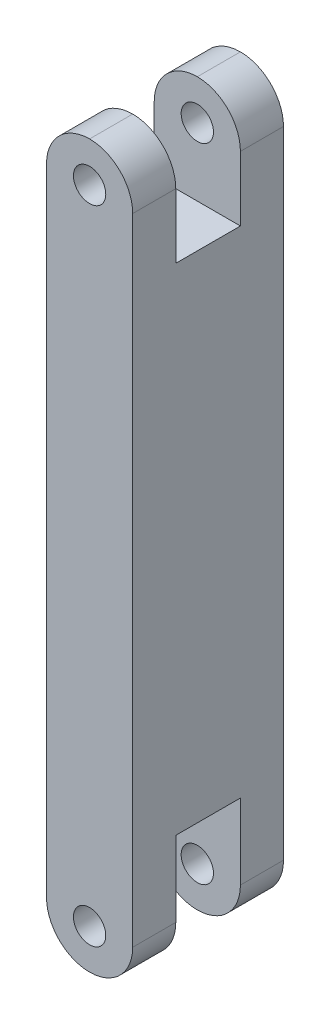
ISO-10303-21;
HEADER;
FILE_DESCRIPTION(('STEP AP214'),'2;1');
FILE_NAME('part.step','',(''),(''),'','','');
FILE_SCHEMA(('AUTOMOTIVE_DESIGN { 1 0 10303 214 1 1 1 1 }'));
ENDSEC;
DATA;
#1=APPLICATION_CONTEXT('core data for automotive mechanical design processes');
#2=APPLICATION_PROTOCOL_DEFINITION('international standard','automotive_design',2000,#1);
#3=PRODUCT_CONTEXT('',#1,'mechanical');
#4=PRODUCT('Part','Part','',(#3));
#5=PRODUCT_RELATED_PRODUCT_CATEGORY('part','',(#4));
#6=PRODUCT_DEFINITION_FORMATION('','',#4);
#7=PRODUCT_DEFINITION_CONTEXT('part definition',#1,'design');
#8=PRODUCT_DEFINITION('design','',#6,#7);
#9=PRODUCT_DEFINITION_SHAPE('','',#8);
#10=(LENGTH_UNIT() NAMED_UNIT(*) SI_UNIT(.MILLI.,.METRE.));
#11=(NAMED_UNIT(*) PLANE_ANGLE_UNIT() SI_UNIT($,.RADIAN.));
#12=(NAMED_UNIT(*) SI_UNIT($,.STERADIAN.) SOLID_ANGLE_UNIT());
#13=UNCERTAINTY_MEASURE_WITH_UNIT(LENGTH_MEASURE(1.E-05),#10,'distance_accuracy_value','');
#14=(GEOMETRIC_REPRESENTATION_CONTEXT(3) GLOBAL_UNCERTAINTY_ASSIGNED_CONTEXT((#13)) GLOBAL_UNIT_ASSIGNED_CONTEXT((#10,
#11,#12)) REPRESENTATION_CONTEXT('',''));
#15=CARTESIAN_POINT('',(0.,0.,0.));
#16=DIRECTION('',(0.,0.,1.));
#17=DIRECTION('',(1.,0.,0.));
#18=AXIS2_PLACEMENT_3D('',#15,#16,#17);
#19=CARTESIAN_POINT('',(0.,29.795,14.));
#20=DIRECTION('',(0.,0.,-1.));
#21=DIRECTION('',(-1.,0.,0.));
#22=AXIS2_PLACEMENT_3D('',#19,#20,#21);
#23=CYLINDRICAL_SURFACE('',#22,1.5);
#24=CARTESIAN_POINT('',(0.,29.795,4.));
#25=DIRECTION('',(0.,0.,-1.));
#26=DIRECTION('',(-1.,0.,0.));
#27=AXIS2_PLACEMENT_3D('',#24,#25,#26);
#28=CIRCLE('',#27,1.5);
#29=CARTESIAN_POINT('',(-1.5,29.795,4.));
#30=VERTEX_POINT('',#29);
#31=EDGE_CURVE('E205',#30,#30,#28,.T.);
#32=ORIENTED_EDGE('',*,*,#31,.F.);
#33=EDGE_LOOP('',(#32));
#34=FACE_BOUND('',#33,.T.);
#35=CARTESIAN_POINT('',(0.,29.795,0.));
#36=DIRECTION('',(0.,0.,1.));
#37=DIRECTION('',(1.,0.,0.));
#38=AXIS2_PLACEMENT_3D('',#35,#36,#37);
#39=CIRCLE('',#38,1.5);
#40=CARTESIAN_POINT('',(1.5,29.795,0.));
#41=VERTEX_POINT('',#40);
#42=EDGE_CURVE('E221',#41,#41,#39,.T.);
#43=ORIENTED_EDGE('',*,*,#42,.F.);
#44=EDGE_LOOP('',(#43));
#45=FACE_BOUND('',#44,.T.);
#46=ADVANCED_FACE('F32',(#34,#45),#23,.F.);
#47=CARTESIAN_POINT('',(0.,-29.795,14.));
#48=DIRECTION('',(0.,0.,-1.));
#49=DIRECTION('',(-1.,0.,0.));
#50=AXIS2_PLACEMENT_3D('',#47,#48,#49);
#51=CYLINDRICAL_SURFACE('',#50,1.5);
#52=CARTESIAN_POINT('',(0.,-29.795,4.));
#53=DIRECTION('',(0.,0.,-1.));
#54=DIRECTION('',(-1.,0.,0.));
#55=AXIS2_PLACEMENT_3D('',#52,#53,#54);
#56=CIRCLE('',#55,1.5);
#57=CARTESIAN_POINT('',(-1.5,-29.795,4.));
#58=VERTEX_POINT('',#57);
#59=EDGE_CURVE('E214',#58,#58,#56,.T.);
#60=ORIENTED_EDGE('',*,*,#59,.F.);
#61=EDGE_LOOP('',(#60));
#62=FACE_BOUND('',#61,.T.);
#63=CARTESIAN_POINT('',(0.,-29.795,0.));
#64=DIRECTION('',(0.,0.,1.));
#65=DIRECTION('',(1.,0.,0.));
#66=AXIS2_PLACEMENT_3D('',#63,#64,#65);
#67=CIRCLE('',#66,1.5);
#68=CARTESIAN_POINT('',(1.5,-29.795,0.));
#69=VERTEX_POINT('',#68);
#70=EDGE_CURVE('E222',#69,#69,#67,.T.);
#71=ORIENTED_EDGE('',*,*,#70,.F.);
#72=EDGE_LOOP('',(#71));
#73=FACE_BOUND('',#72,.T.);
#74=ADVANCED_FACE('F350',(#62,#73),#51,.F.);
#75=CARTESIAN_POINT('',(0.,-29.495,14.));
#76=DIRECTION('',(0.,0.,-1.));
#77=DIRECTION('',(-1.,0.,0.));
#78=AXIS2_PLACEMENT_3D('',#75,#76,#77);
#79=CYLINDRICAL_SURFACE('',#78,4.);
#80=CARTESIAN_POINT('',(0.,-29.495,4.));
#81=DIRECTION('',(0.,0.,-1.));
#82=DIRECTION('',(-1.,0.,0.));
#83=AXIS2_PLACEMENT_3D('',#80,#81,#82);
#84=CIRCLE('',#83,4.);
#85=CARTESIAN_POINT('',(0.,-33.495,4.));
#86=VERTEX_POINT('',#85);
#87=CARTESIAN_POINT('',(4.,-29.495,4.));
#88=VERTEX_POINT('',#87);
#89=EDGE_CURVE('E212',#86,#88,#84,.F.);
#90=ORIENTED_EDGE('',*,*,#89,.F.);
#91=DIRECTION('',(0.,0.,-1.));
#92=VECTOR('',#91,1.);
#93=CARTESIAN_POINT('',(0.,-33.495,14.));
#94=LINE('',#93,#92);
#95=CARTESIAN_POINT('',(0.,-33.495,0.));
#96=VERTEX_POINT('',#95);
#97=EDGE_CURVE('E225',#96,#86,#94,.F.);
#98=ORIENTED_EDGE('',*,*,#97,.F.);
#99=CARTESIAN_POINT('',(0.,-29.495,0.));
#100=DIRECTION('',(0.,0.,-1.));
#101=DIRECTION('',(-1.,0.,0.));
#102=AXIS2_PLACEMENT_3D('',#99,#100,#101);
#103=CIRCLE('',#102,4.);
#104=CARTESIAN_POINT('',(4.,-29.495,0.));
#105=VERTEX_POINT('',#104);
#106=EDGE_CURVE('E247',#105,#96,#103,.T.);
#107=ORIENTED_EDGE('',*,*,#106,.F.);
#108=DIRECTION('',(0.,0.,-1.));
#109=VECTOR('',#108,1.);
#110=CARTESIAN_POINT('',(4.,-29.495,14.));
#111=LINE('',#110,#109);
#112=EDGE_CURVE('E270',#88,#105,#111,.T.);
#113=ORIENTED_EDGE('',*,*,#112,.F.);
#114=EDGE_LOOP('',(#90,#98,#107,#113));
#115=FACE_BOUND('',#114,.T.);
#116=ADVANCED_FACE('F324',(#115),#79,.T.);
#117=CARTESIAN_POINT('',(0.,-29.495,14.));
#118=DIRECTION('',(0.,0.,-1.));
#119=DIRECTION('',(-1.,0.,0.));
#120=AXIS2_PLACEMENT_3D('',#117,#118,#119);
#121=CYLINDRICAL_SURFACE('',#120,4.);
#122=CARTESIAN_POINT('',(0.,-29.495,4.));
#123=DIRECTION('',(0.,0.,-1.));
#124=DIRECTION('',(-1.,0.,0.));
#125=AXIS2_PLACEMENT_3D('',#122,#123,#124);
#126=CIRCLE('',#125,4.);
#127=CARTESIAN_POINT('',(-4.,-29.495,4.));
#128=VERTEX_POINT('',#127);
#129=EDGE_CURVE('E11',#128,#86,#126,.F.);
#130=ORIENTED_EDGE('',*,*,#129,.F.);
#131=DIRECTION('',(0.,0.,-1.));
#132=VECTOR('',#131,1.);
#133=CARTESIAN_POINT('',(-4.,-29.495,14.));
#134=LINE('',#133,#132);
#135=CARTESIAN_POINT('',(-4.,-29.495,0.));
#136=VERTEX_POINT('',#135);
#137=EDGE_CURVE('E256',#136,#128,#134,.F.);
#138=ORIENTED_EDGE('',*,*,#137,.F.);
#139=CARTESIAN_POINT('',(0.,-29.495,0.));
#140=DIRECTION('',(0.,0.,-1.));
#141=DIRECTION('',(-1.,0.,0.));
#142=AXIS2_PLACEMENT_3D('',#139,#140,#141);
#143=CIRCLE('',#142,4.);
#144=EDGE_CURVE('E249',#96,#136,#143,.T.);
#145=ORIENTED_EDGE('',*,*,#144,.F.);
#146=ORIENTED_EDGE('',*,*,#97,.T.);
#147=EDGE_LOOP('',(#130,#138,#145,#146));
#148=FACE_BOUND('',#147,.T.);
#149=ADVANCED_FACE('F343',(#148),#121,.T.);
#150=CARTESIAN_POINT('',(0.,29.495,14.));
#151=DIRECTION('',(0.,0.,-1.));
#152=DIRECTION('',(-1.,0.,0.));
#153=AXIS2_PLACEMENT_3D('',#150,#151,#152);
#154=CYLINDRICAL_SURFACE('',#153,4.);
#155=CARTESIAN_POINT('',(0.,29.495,4.));
#156=DIRECTION('',(0.,0.,-1.));
#157=DIRECTION('',(-1.,0.,0.));
#158=AXIS2_PLACEMENT_3D('',#155,#156,#157);
#159=CIRCLE('',#158,4.);
#160=CARTESIAN_POINT('',(4.,29.495,4.));
#161=VERTEX_POINT('',#160);
#162=CARTESIAN_POINT('',(0.,33.495,4.));
#163=VERTEX_POINT('',#162);
#164=EDGE_CURVE('E203',#161,#163,#159,.F.);
#165=ORIENTED_EDGE('',*,*,#164,.F.);
#166=DIRECTION('',(0.,0.,-1.));
#167=VECTOR('',#166,1.);
#168=CARTESIAN_POINT('',(4.,29.495,14.));
#169=LINE('',#168,#167);
#170=CARTESIAN_POINT('',(4.,29.495,0.));
#171=VERTEX_POINT('',#170);
#172=EDGE_CURVE('E168',#171,#161,#169,.F.);
#173=ORIENTED_EDGE('',*,*,#172,.F.);
#174=CARTESIAN_POINT('',(0.,29.495,0.));
#175=DIRECTION('',(0.,0.,-1.));
#176=DIRECTION('',(-1.,0.,0.));
#177=AXIS2_PLACEMENT_3D('',#174,#175,#176);
#178=CIRCLE('',#177,4.);
#179=CARTESIAN_POINT('',(0.,33.495,0.));
#180=VERTEX_POINT('',#179);
#181=EDGE_CURVE('E239',#180,#171,#178,.T.);
#182=ORIENTED_EDGE('',*,*,#181,.F.);
#183=DIRECTION('',(0.,0.,-1.));
#184=VECTOR('',#183,1.);
#185=CARTESIAN_POINT('',(0.,33.495,14.));
#186=LINE('',#185,#184);
#187=EDGE_CURVE('E217',#163,#180,#186,.T.);
#188=ORIENTED_EDGE('',*,*,#187,.F.);
#189=EDGE_LOOP('',(#165,#173,#182,#188));
#190=FACE_BOUND('',#189,.T.);
#191=ADVANCED_FACE('F333',(#190),#154,.T.);
#192=CARTESIAN_POINT('',(0.,29.495,14.));
#193=DIRECTION('',(0.,0.,-1.));
#194=DIRECTION('',(-1.,0.,0.));
#195=AXIS2_PLACEMENT_3D('',#192,#193,#194);
#196=CYLINDRICAL_SURFACE('',#195,4.);
#197=CARTESIAN_POINT('',(0.,29.495,4.));
#198=DIRECTION('',(0.,0.,-1.));
#199=DIRECTION('',(-1.,0.,0.));
#200=AXIS2_PLACEMENT_3D('',#197,#198,#199);
#201=CIRCLE('',#200,4.);
#202=CARTESIAN_POINT('',(-4.,29.495,4.));
#203=VERTEX_POINT('',#202);
#204=EDGE_CURVE('E282',#163,#203,#201,.F.);
#205=ORIENTED_EDGE('',*,*,#204,.F.);
#206=ORIENTED_EDGE('',*,*,#187,.T.);
#207=CARTESIAN_POINT('',(0.,29.495,0.));
#208=DIRECTION('',(0.,0.,-1.));
#209=DIRECTION('',(-1.,0.,0.));
#210=AXIS2_PLACEMENT_3D('',#207,#208,#209);
#211=CIRCLE('',#210,4.);
#212=CARTESIAN_POINT('',(-4.,29.495,0.));
#213=VERTEX_POINT('',#212);
#214=EDGE_CURVE('E244',#213,#180,#211,.T.);
#215=ORIENTED_EDGE('',*,*,#214,.F.);
#216=DIRECTION('',(0.,0.,-1.));
#217=VECTOR('',#216,1.);
#218=CARTESIAN_POINT('',(-4.,29.495,14.));
#219=LINE('',#218,#217);
#220=EDGE_CURVE('E251',#203,#213,#219,.T.);
#221=ORIENTED_EDGE('',*,*,#220,.F.);
#222=EDGE_LOOP('',(#205,#206,#215,#221));
#223=FACE_BOUND('',#222,.T.);
#224=ADVANCED_FACE('F338',(#223),#196,.T.);
#225=CARTESIAN_POINT('',(0.,0.,14.));
#226=DIRECTION('',(0.,0.,-1.));
#227=DIRECTION('',(-1.,0.,0.));
#228=AXIS2_PLACEMENT_3D('',#225,#226,#227);
#229=PLANE('',#228);
#230=DIRECTION('',(0.,-1.,0.));
#231=VECTOR('',#230,1.);
#232=CARTESIAN_POINT('',(-4.,-33.495,14.));
#233=LINE('',#232,#231);
#234=CARTESIAN_POINT('',(-4.,29.495,14.));
#235=VERTEX_POINT('',#234);
#236=CARTESIAN_POINT('',(-4.,-29.495,14.));
#237=VERTEX_POINT('',#236);
#238=EDGE_CURVE('E235',#235,#237,#233,.T.);
#239=ORIENTED_EDGE('',*,*,#238,.T.);
#240=CARTESIAN_POINT('',(0.,-29.495,14.));
#241=DIRECTION('',(0.,0.,-1.));
#242=DIRECTION('',(-1.,0.,0.));
#243=AXIS2_PLACEMENT_3D('',#240,#241,#242);
#244=CIRCLE('',#243,4.);
#245=CARTESIAN_POINT('',(0.,-33.495,14.));
#246=VERTEX_POINT('',#245);
#247=EDGE_CURVE('E265',#237,#246,#244,.F.);
#248=ORIENTED_EDGE('',*,*,#247,.T.);
#249=CARTESIAN_POINT('',(0.,-29.495,14.));
#250=DIRECTION('',(0.,0.,-1.));
#251=DIRECTION('',(-1.,0.,0.));
#252=AXIS2_PLACEMENT_3D('',#249,#250,#251);
#253=CIRCLE('',#252,4.);
#254=CARTESIAN_POINT('',(4.,-29.495,14.));
#255=VERTEX_POINT('',#254);
#256=EDGE_CURVE('E263',#246,#255,#253,.F.);
#257=ORIENTED_EDGE('',*,*,#256,.T.);
#258=DIRECTION('',(0.,1.,0.));
#259=VECTOR('',#258,1.);
#260=CARTESIAN_POINT('',(4.,-33.495,14.));
#261=LINE('',#260,#259);
#262=CARTESIAN_POINT('',(4.,29.495,14.));
#263=VERTEX_POINT('',#262);
#264=EDGE_CURVE('E232',#255,#263,#261,.T.);
#265=ORIENTED_EDGE('',*,*,#264,.T.);
#266=CARTESIAN_POINT('',(0.,29.495,14.));
#267=DIRECTION('',(0.,0.,-1.));
#268=DIRECTION('',(-1.,0.,0.));
#269=AXIS2_PLACEMENT_3D('',#266,#267,#268);
#270=CIRCLE('',#269,4.);
#271=CARTESIAN_POINT('',(0.,33.495,14.));
#272=VERTEX_POINT('',#271);
#273=EDGE_CURVE('E259',#263,#272,#270,.F.);
#274=ORIENTED_EDGE('',*,*,#273,.T.);
#275=CARTESIAN_POINT('',(0.,29.495,14.));
#276=DIRECTION('',(0.,0.,-1.));
#277=DIRECTION('',(-1.,0.,0.));
#278=AXIS2_PLACEMENT_3D('',#275,#276,#277);
#279=CIRCLE('',#278,4.);
#280=EDGE_CURVE('E261',#272,#235,#279,.F.);
#281=ORIENTED_EDGE('',*,*,#280,.T.);
#282=EDGE_LOOP('',(#239,#248,#257,#265,#274,#281));
#283=FACE_BOUND('',#282,.T.);
#284=CARTESIAN_POINT('',(0.,29.795,14.));
#285=DIRECTION('',(0.,0.,1.));
#286=DIRECTION('',(1.,0.,0.));
#287=AXIS2_PLACEMENT_3D('',#284,#285,#286);
#288=CIRCLE('',#287,1.5);
#289=CARTESIAN_POINT('',(1.5,29.795,14.));
#290=VERTEX_POINT('',#289);
#291=EDGE_CURVE('E226',#290,#290,#288,.T.);
#292=ORIENTED_EDGE('',*,*,#291,.F.);
#293=EDGE_LOOP('',(#292));
#294=FACE_BOUND('',#293,.T.);
#295=CARTESIAN_POINT('',(0.,-29.795,14.));
#296=DIRECTION('',(0.,0.,1.));
#297=DIRECTION('',(1.,0.,0.));
#298=AXIS2_PLACEMENT_3D('',#295,#296,#297);
#299=CIRCLE('',#298,1.5);
#300=CARTESIAN_POINT('',(1.5,-29.795,14.));
#301=VERTEX_POINT('',#300);
#302=EDGE_CURVE('E218',#301,#301,#299,.T.);
#303=ORIENTED_EDGE('',*,*,#302,.F.);
#304=EDGE_LOOP('',(#303));
#305=FACE_BOUND('',#304,.T.);
#306=ADVANCED_FACE('F297',(#283,#294,#305),#229,.F.);
#307=CARTESIAN_POINT('',(0.,0.,0.));
#308=DIRECTION('',(0.,0.,-1.));
#309=DIRECTION('',(-1.,0.,0.));
#310=AXIS2_PLACEMENT_3D('',#307,#308,#309);
#311=PLANE('',#310);
#312=ORIENTED_EDGE('',*,*,#42,.T.);
#313=EDGE_LOOP('',(#312));
#314=FACE_BOUND('',#313,.T.);
#315=ORIENTED_EDGE('',*,*,#106,.T.);
#316=ORIENTED_EDGE('',*,*,#144,.T.);
#317=DIRECTION('',(0.,-1.,0.));
#318=VECTOR('',#317,1.);
#319=CARTESIAN_POINT('',(-4.,-33.495,0.));
#320=LINE('',#319,#318);
#321=EDGE_CURVE('E236',#213,#136,#320,.T.);
#322=ORIENTED_EDGE('',*,*,#321,.F.);
#323=ORIENTED_EDGE('',*,*,#214,.T.);
#324=ORIENTED_EDGE('',*,*,#181,.T.);
#325=DIRECTION('',(0.,1.,0.));
#326=VECTOR('',#325,1.);
#327=CARTESIAN_POINT('',(4.,-33.495,0.));
#328=LINE('',#327,#326);
#329=EDGE_CURVE('E229',#105,#171,#328,.T.);
#330=ORIENTED_EDGE('',*,*,#329,.F.);
#331=EDGE_LOOP('',(#315,#316,#322,#323,#324,#330));
#332=FACE_BOUND('',#331,.T.);
#333=ORIENTED_EDGE('',*,*,#70,.T.);
#334=EDGE_LOOP('',(#333));
#335=FACE_BOUND('',#334,.T.);
#336=ADVANCED_FACE('F328',(#314,#332,#335),#311,.T.);
#337=CARTESIAN_POINT('',(4.,-33.495,14.));
#338=DIRECTION('',(-1.,0.,0.));
#339=DIRECTION('',(0.,0.,1.));
#340=AXIS2_PLACEMENT_3D('',#337,#338,#339);
#341=PLANE('',#340);
#342=ORIENTED_EDGE('',*,*,#172,.T.);
#343=DIRECTION('',(0.,-1.,0.));
#344=VECTOR('',#343,1.);
#345=CARTESIAN_POINT('',(4.,33.495,4.));
#346=LINE('',#345,#344);
#347=CARTESIAN_POINT('',(4.,23.495,4.));
#348=VERTEX_POINT('',#347);
#349=EDGE_CURVE('E147',#161,#348,#346,.T.);
#350=ORIENTED_EDGE('',*,*,#349,.T.);
#351=DIRECTION('',(0.,0.,1.));
#352=VECTOR('',#351,1.);
#353=CARTESIAN_POINT('',(4.,23.495,4.));
#354=LINE('',#353,#352);
#355=CARTESIAN_POINT('',(4.,23.495,10.));
#356=VERTEX_POINT('',#355);
#357=EDGE_CURVE('E158',#348,#356,#354,.T.);
#358=ORIENTED_EDGE('',*,*,#357,.T.);
#359=DIRECTION('',(0.,1.,0.));
#360=VECTOR('',#359,1.);
#361=CARTESIAN_POINT('',(4.,33.495,10.));
#362=LINE('',#361,#360);
#363=CARTESIAN_POINT('',(4.,29.495,10.));
#364=VERTEX_POINT('',#363);
#365=EDGE_CURVE('E155',#356,#364,#362,.T.);
#366=ORIENTED_EDGE('',*,*,#365,.T.);
#367=EDGE_CURVE('E268',#364,#263,#169,.F.);
#368=ORIENTED_EDGE('',*,*,#367,.T.);
#369=ORIENTED_EDGE('',*,*,#264,.F.);
#370=CARTESIAN_POINT('',(4.,-29.495,10.));
#371=VERTEX_POINT('',#370);
#372=EDGE_CURVE('E271',#255,#371,#111,.T.);
#373=ORIENTED_EDGE('',*,*,#372,.T.);
#374=DIRECTION('',(0.,1.,0.));
#375=VECTOR('',#374,1.);
#376=CARTESIAN_POINT('',(4.,-33.495,10.));
#377=LINE('',#376,#375);
#378=CARTESIAN_POINT('',(4.,-22.495,10.));
#379=VERTEX_POINT('',#378);
#380=EDGE_CURVE('E182',#371,#379,#377,.T.);
#381=ORIENTED_EDGE('',*,*,#380,.T.);
#382=DIRECTION('',(0.,0.,-1.));
#383=VECTOR('',#382,1.);
#384=CARTESIAN_POINT('',(4.,-22.495,4.));
#385=LINE('',#384,#383);
#386=CARTESIAN_POINT('',(4.,-22.495,4.));
#387=VERTEX_POINT('',#386);
#388=EDGE_CURVE('E186',#379,#387,#385,.T.);
#389=ORIENTED_EDGE('',*,*,#388,.T.);
#390=DIRECTION('',(0.,-1.,0.));
#391=VECTOR('',#390,1.);
#392=CARTESIAN_POINT('',(4.,-33.495,4.));
#393=LINE('',#392,#391);
#394=EDGE_CURVE('E179',#387,#88,#393,.T.);
#395=ORIENTED_EDGE('',*,*,#394,.T.);
#396=ORIENTED_EDGE('',*,*,#112,.T.);
#397=ORIENTED_EDGE('',*,*,#329,.T.);
#398=EDGE_LOOP('',(#342,#350,#358,#366,#368,#369,#373,#381,#389,#395,#396,#397));
#399=FACE_BOUND('',#398,.T.);
#400=ADVANCED_FACE('F165',(#399),#341,.F.);
#401=CARTESIAN_POINT('',(-4.,-33.495,14.));
#402=DIRECTION('',(1.,0.,0.));
#403=DIRECTION('',(0.,0.,-1.));
#404=AXIS2_PLACEMENT_3D('',#401,#402,#403);
#405=PLANE('',#404);
#406=DIRECTION('',(0.,0.,1.));
#407=VECTOR('',#406,1.);
#408=CARTESIAN_POINT('',(-4.,23.495,4.));
#409=LINE('',#408,#407);
#410=CARTESIAN_POINT('',(-4.,23.495,4.));
#411=VERTEX_POINT('',#410);
#412=CARTESIAN_POINT('',(-4.,23.495,10.));
#413=VERTEX_POINT('',#412);
#414=EDGE_CURVE('E170',#411,#413,#409,.T.);
#415=ORIENTED_EDGE('',*,*,#414,.F.);
#416=DIRECTION('',(0.,-1.,0.));
#417=VECTOR('',#416,1.);
#418=CARTESIAN_POINT('',(-4.,33.495,4.));
#419=LINE('',#418,#417);
#420=EDGE_CURVE('E150',#203,#411,#419,.T.);
#421=ORIENTED_EDGE('',*,*,#420,.F.);
#422=ORIENTED_EDGE('',*,*,#220,.T.);
#423=ORIENTED_EDGE('',*,*,#321,.T.);
#424=ORIENTED_EDGE('',*,*,#137,.T.);
#425=DIRECTION('',(0.,-1.,0.));
#426=VECTOR('',#425,1.);
#427=CARTESIAN_POINT('',(-4.,-33.495,4.));
#428=LINE('',#427,#426);
#429=CARTESIAN_POINT('',(-4.,-22.495,4.));
#430=VERTEX_POINT('',#429);
#431=EDGE_CURVE('E190',#430,#128,#428,.T.);
#432=ORIENTED_EDGE('',*,*,#431,.F.);
#433=DIRECTION('',(0.,0.,-1.));
#434=VECTOR('',#433,1.);
#435=CARTESIAN_POINT('',(-4.,-22.495,4.));
#436=LINE('',#435,#434);
#437=CARTESIAN_POINT('',(-4.,-22.495,10.));
#438=VERTEX_POINT('',#437);
#439=EDGE_CURVE('E183',#438,#430,#436,.T.);
#440=ORIENTED_EDGE('',*,*,#439,.F.);
#441=DIRECTION('',(0.,1.,0.));
#442=VECTOR('',#441,1.);
#443=CARTESIAN_POINT('',(-4.,-33.495,10.));
#444=LINE('',#443,#442);
#445=CARTESIAN_POINT('',(-4.,-29.495,10.));
#446=VERTEX_POINT('',#445);
#447=EDGE_CURVE('E192',#446,#438,#444,.T.);
#448=ORIENTED_EDGE('',*,*,#447,.F.);
#449=EDGE_CURVE('E255',#446,#237,#134,.F.);
#450=ORIENTED_EDGE('',*,*,#449,.T.);
#451=ORIENTED_EDGE('',*,*,#238,.F.);
#452=CARTESIAN_POINT('',(-4.,29.495,10.));
#453=VERTEX_POINT('',#452);
#454=EDGE_CURVE('E252',#235,#453,#219,.T.);
#455=ORIENTED_EDGE('',*,*,#454,.T.);
#456=DIRECTION('',(0.,1.,0.));
#457=VECTOR('',#456,1.);
#458=CARTESIAN_POINT('',(-4.,33.495,10.));
#459=LINE('',#458,#457);
#460=EDGE_CURVE('E55',#413,#453,#459,.T.);
#461=ORIENTED_EDGE('',*,*,#460,.F.);
#462=EDGE_LOOP('',(#415,#421,#422,#423,#424,#432,#440,#448,#450,#451,#455,#461));
#463=FACE_BOUND('',#462,.T.);
#464=ADVANCED_FACE('F290',(#463),#405,.F.);
#465=CARTESIAN_POINT('',(0.,29.795,10.));
#466=DIRECTION('',(0.,0.,1.));
#467=DIRECTION('',(0.,-1.,0.));
#468=AXIS2_PLACEMENT_3D('',#465,#466,#467);
#469=CIRCLE('',#468,1.5);
#470=CARTESIAN_POINT('',(0.,28.295,10.));
#471=VERTEX_POINT('',#470);
#472=EDGE_CURVE('E200',#471,#471,#469,.T.);
#473=ORIENTED_EDGE('',*,*,#472,.F.);
#474=EDGE_LOOP('',(#473));
#475=FACE_BOUND('',#474,.T.);
#476=ORIENTED_EDGE('',*,*,#291,.T.);
#477=EDGE_LOOP('',(#476));
#478=FACE_BOUND('',#477,.T.);
#479=ADVANCED_FACE('F357',(#475,#478),#23,.F.);
#480=CARTESIAN_POINT('',(0.,-29.795,10.));
#481=DIRECTION('',(0.,0.,1.));
#482=DIRECTION('',(1.,0.,0.));
#483=AXIS2_PLACEMENT_3D('',#480,#481,#482);
#484=CIRCLE('',#483,1.5);
#485=CARTESIAN_POINT('',(1.5,-29.795,10.));
#486=VERTEX_POINT('',#485);
#487=EDGE_CURVE('E209',#486,#486,#484,.T.);
#488=ORIENTED_EDGE('',*,*,#487,.F.);
#489=EDGE_LOOP('',(#488));
#490=FACE_BOUND('',#489,.T.);
#491=ORIENTED_EDGE('',*,*,#302,.T.);
#492=EDGE_LOOP('',(#491));
#493=FACE_BOUND('',#492,.T.);
#494=ADVANCED_FACE('F363',(#490,#493),#51,.F.);
#495=CARTESIAN_POINT('',(0.,-29.495,10.));
#496=DIRECTION('',(0.,0.,1.));
#497=DIRECTION('',(1.,0.,0.));
#498=AXIS2_PLACEMENT_3D('',#495,#496,#497);
#499=CIRCLE('',#498,4.);
#500=CARTESIAN_POINT('',(0.,-33.495,10.));
#501=VERTEX_POINT('',#500);
#502=EDGE_CURVE('E47',#371,#501,#499,.F.);
#503=ORIENTED_EDGE('',*,*,#502,.F.);
#504=ORIENTED_EDGE('',*,*,#372,.F.);
#505=ORIENTED_EDGE('',*,*,#256,.F.);
#506=EDGE_CURVE('E277',#501,#246,#94,.F.);
#507=ORIENTED_EDGE('',*,*,#506,.F.);
#508=EDGE_LOOP('',(#503,#504,#505,#507));
#509=FACE_BOUND('',#508,.T.);
#510=ADVANCED_FACE('F312',(#509),#79,.T.);
#511=CARTESIAN_POINT('',(0.,-29.495,10.));
#512=DIRECTION('',(0.,0.,1.));
#513=DIRECTION('',(1.,0.,0.));
#514=AXIS2_PLACEMENT_3D('',#511,#512,#513);
#515=CIRCLE('',#514,4.);
#516=EDGE_CURVE('E40',#501,#446,#515,.F.);
#517=ORIENTED_EDGE('',*,*,#516,.F.);
#518=ORIENTED_EDGE('',*,*,#506,.T.);
#519=ORIENTED_EDGE('',*,*,#247,.F.);
#520=ORIENTED_EDGE('',*,*,#449,.F.);
#521=EDGE_LOOP('',(#517,#518,#519,#520));
#522=FACE_BOUND('',#521,.T.);
#523=ADVANCED_FACE('F294',(#522),#121,.T.);
#524=CARTESIAN_POINT('',(0.,29.495,10.));
#525=DIRECTION('',(0.,0.,1.));
#526=DIRECTION('',(0.,-1.,0.));
#527=AXIS2_PLACEMENT_3D('',#524,#525,#526);
#528=CIRCLE('',#527,4.);
#529=CARTESIAN_POINT('',(0.,33.495,10.));
#530=VERTEX_POINT('',#529);
#531=EDGE_CURVE('E177',#530,#364,#528,.F.);
#532=ORIENTED_EDGE('',*,*,#531,.F.);
#533=EDGE_CURVE('E278',#272,#530,#186,.T.);
#534=ORIENTED_EDGE('',*,*,#533,.F.);
#535=ORIENTED_EDGE('',*,*,#273,.F.);
#536=ORIENTED_EDGE('',*,*,#367,.F.);
#537=EDGE_LOOP('',(#532,#534,#535,#536));
#538=FACE_BOUND('',#537,.T.);
#539=ADVANCED_FACE('F34',(#538),#154,.T.);
#540=CARTESIAN_POINT('',(0.,29.495,10.));
#541=DIRECTION('',(0.,0.,1.));
#542=DIRECTION('',(0.,-1.,0.));
#543=AXIS2_PLACEMENT_3D('',#540,#541,#542);
#544=CIRCLE('',#543,4.);
#545=EDGE_CURVE('E274',#453,#530,#544,.F.);
#546=ORIENTED_EDGE('',*,*,#545,.F.);
#547=ORIENTED_EDGE('',*,*,#454,.F.);
#548=ORIENTED_EDGE('',*,*,#280,.F.);
#549=ORIENTED_EDGE('',*,*,#533,.T.);
#550=EDGE_LOOP('',(#546,#547,#548,#549));
#551=FACE_BOUND('',#550,.T.);
#552=ADVANCED_FACE('F302',(#551),#196,.T.);
#553=CARTESIAN_POINT('',(4.,33.495,4.));
#554=DIRECTION('',(0.,0.,-1.));
#555=DIRECTION('',(-1.,0.,0.));
#556=AXIS2_PLACEMENT_3D('',#553,#554,#555);
#557=PLANE('',#556);
#558=ORIENTED_EDGE('',*,*,#31,.T.);
#559=EDGE_LOOP('',(#558));
#560=FACE_BOUND('',#559,.T.);
#561=ORIENTED_EDGE('',*,*,#164,.T.);
#562=ORIENTED_EDGE('',*,*,#204,.T.);
#563=ORIENTED_EDGE('',*,*,#420,.T.);
#564=DIRECTION('',(-1.,0.,0.));
#565=VECTOR('',#564,1.);
#566=CARTESIAN_POINT('',(4.,23.495,4.));
#567=LINE('',#566,#565);
#568=EDGE_CURVE('E143',#348,#411,#567,.T.);
#569=ORIENTED_EDGE('',*,*,#568,.F.);
#570=ORIENTED_EDGE('',*,*,#349,.F.);
#571=EDGE_LOOP('',(#561,#562,#563,#569,#570));
#572=FACE_BOUND('',#571,.T.);
#573=ADVANCED_FACE('F145',(#560,#572),#557,.F.);
#574=CARTESIAN_POINT('',(4.,33.495,10.));
#575=DIRECTION('',(0.,0.,1.));
#576=DIRECTION('',(0.,-1.,0.));
#577=AXIS2_PLACEMENT_3D('',#574,#575,#576);
#578=PLANE('',#577);
#579=ORIENTED_EDGE('',*,*,#472,.T.);
#580=EDGE_LOOP('',(#579));
#581=FACE_BOUND('',#580,.T.);
#582=ORIENTED_EDGE('',*,*,#531,.T.);
#583=ORIENTED_EDGE('',*,*,#365,.F.);
#584=DIRECTION('',(-1.,0.,0.));
#585=VECTOR('',#584,1.);
#586=CARTESIAN_POINT('',(4.,23.495,10.));
#587=LINE('',#586,#585);
#588=EDGE_CURVE('E154',#356,#413,#587,.T.);
#589=ORIENTED_EDGE('',*,*,#588,.T.);
#590=ORIENTED_EDGE('',*,*,#460,.T.);
#591=ORIENTED_EDGE('',*,*,#545,.T.);
#592=EDGE_LOOP('',(#582,#583,#589,#590,#591));
#593=FACE_BOUND('',#592,.T.);
#594=ADVANCED_FACE('F305',(#581,#593),#578,.F.);
#595=CARTESIAN_POINT('',(4.,23.495,4.));
#596=DIRECTION('',(0.,-1.,0.));
#597=DIRECTION('',(0.,0.,-1.));
#598=AXIS2_PLACEMENT_3D('',#595,#596,#597);
#599=PLANE('',#598);
#600=ORIENTED_EDGE('',*,*,#414,.T.);
#601=ORIENTED_EDGE('',*,*,#588,.F.);
#602=ORIENTED_EDGE('',*,*,#357,.F.);
#603=ORIENTED_EDGE('',*,*,#568,.T.);
#604=EDGE_LOOP('',(#600,#601,#602,#603));
#605=FACE_BOUND('',#604,.T.);
#606=ADVANCED_FACE('F159',(#605),#599,.F.);
#607=CARTESIAN_POINT('',(4.,-33.495,4.));
#608=DIRECTION('',(0.,0.,-1.));
#609=DIRECTION('',(-1.,0.,0.));
#610=AXIS2_PLACEMENT_3D('',#607,#608,#609);
#611=PLANE('',#610);
#612=ORIENTED_EDGE('',*,*,#59,.T.);
#613=EDGE_LOOP('',(#612));
#614=FACE_BOUND('',#613,.T.);
#615=ORIENTED_EDGE('',*,*,#89,.T.);
#616=ORIENTED_EDGE('',*,*,#394,.F.);
#617=DIRECTION('',(-1.,0.,0.));
#618=VECTOR('',#617,1.);
#619=CARTESIAN_POINT('',(4.,-22.495,4.));
#620=LINE('',#619,#618);
#621=EDGE_CURVE('E175',#387,#430,#620,.T.);
#622=ORIENTED_EDGE('',*,*,#621,.T.);
#623=ORIENTED_EDGE('',*,*,#431,.T.);
#624=ORIENTED_EDGE('',*,*,#129,.T.);
#625=EDGE_LOOP('',(#615,#616,#622,#623,#624));
#626=FACE_BOUND('',#625,.T.);
#627=ADVANCED_FACE('F318',(#614,#626),#611,.F.);
#628=CARTESIAN_POINT('',(4.,-22.495,4.));
#629=DIRECTION('',(0.,1.,0.));
#630=DIRECTION('',(0.,0.,1.));
#631=AXIS2_PLACEMENT_3D('',#628,#629,#630);
#632=PLANE('',#631);
#633=ORIENTED_EDGE('',*,*,#439,.T.);
#634=ORIENTED_EDGE('',*,*,#621,.F.);
#635=ORIENTED_EDGE('',*,*,#388,.F.);
#636=DIRECTION('',(-1.,0.,0.));
#637=VECTOR('',#636,1.);
#638=CARTESIAN_POINT('',(4.,-22.495,10.));
#639=LINE('',#638,#637);
#640=EDGE_CURVE('E189',#379,#438,#639,.T.);
#641=ORIENTED_EDGE('',*,*,#640,.T.);
#642=EDGE_LOOP('',(#633,#634,#635,#641));
#643=FACE_BOUND('',#642,.T.);
#644=ADVANCED_FACE('F315',(#643),#632,.F.);
#645=CARTESIAN_POINT('',(4.,-33.495,10.));
#646=DIRECTION('',(0.,0.,1.));
#647=DIRECTION('',(1.,0.,0.));
#648=AXIS2_PLACEMENT_3D('',#645,#646,#647);
#649=PLANE('',#648);
#650=ORIENTED_EDGE('',*,*,#487,.T.);
#651=EDGE_LOOP('',(#650));
#652=FACE_BOUND('',#651,.T.);
#653=ORIENTED_EDGE('',*,*,#502,.T.);
#654=ORIENTED_EDGE('',*,*,#516,.T.);
#655=ORIENTED_EDGE('',*,*,#447,.T.);
#656=ORIENTED_EDGE('',*,*,#640,.F.);
#657=ORIENTED_EDGE('',*,*,#380,.F.);
#658=EDGE_LOOP('',(#653,#654,#655,#656,#657));
#659=FACE_BOUND('',#658,.T.);
#660=ADVANCED_FACE('F284',(#652,#659),#649,.F.);
#661=CLOSED_SHELL('',(#46,#74,#116,#149,#191,#224,#306,#336,#400,#464,#479,#494,#510,#523,#539,
#552,#573,#594,#606,#627,#644,#660));
#662=MANIFOLD_SOLID_BREP('B2',#661);
#663=ADVANCED_BREP_SHAPE_REPRESENTATION('',(#18,#662),#14);
#664=SHAPE_DEFINITION_REPRESENTATION(#9,#663);
ENDSEC;
END-ISO-10303-21;
